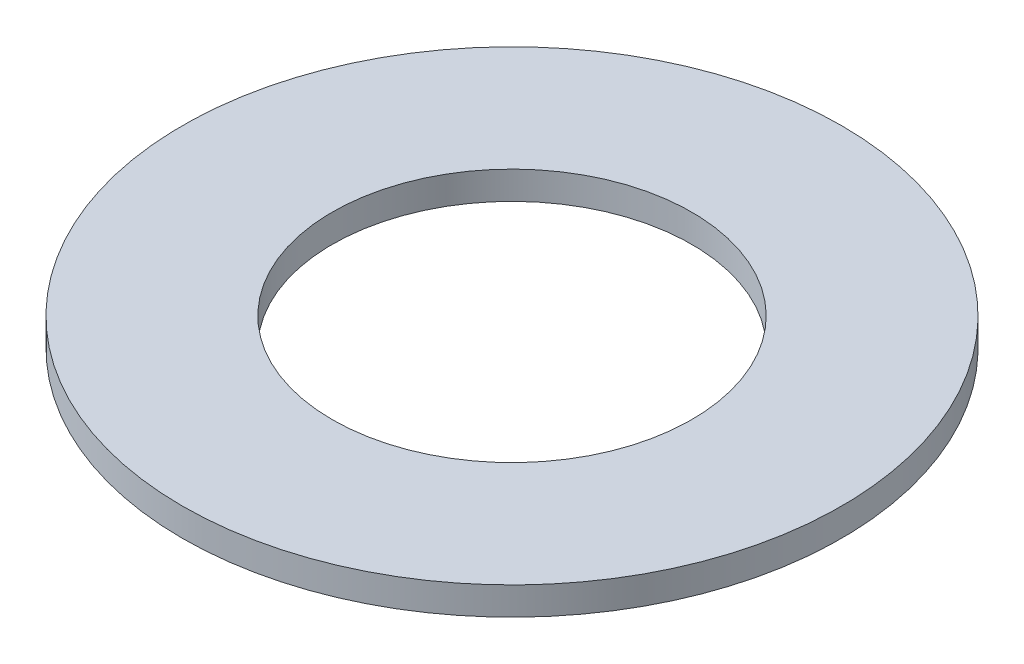
ISO-10303-21;
HEADER;
FILE_DESCRIPTION(('STEP AP214'),'2;1');
FILE_NAME('part.step','',(''),(''),'','','');
FILE_SCHEMA(('AUTOMOTIVE_DESIGN { 1 0 10303 214 1 1 1 1 }'));
ENDSEC;
DATA;
#1=APPLICATION_CONTEXT('core data for automotive mechanical design processes');
#2=APPLICATION_PROTOCOL_DEFINITION('international standard','automotive_design',2000,#1);
#3=PRODUCT_CONTEXT('',#1,'mechanical');
#4=PRODUCT('Part','Part','',(#3));
#5=PRODUCT_RELATED_PRODUCT_CATEGORY('part','',(#4));
#6=PRODUCT_DEFINITION_FORMATION('','',#4);
#7=PRODUCT_DEFINITION_CONTEXT('part definition',#1,'design');
#8=PRODUCT_DEFINITION('design','',#6,#7);
#9=PRODUCT_DEFINITION_SHAPE('','',#8);
#10=(LENGTH_UNIT() NAMED_UNIT(*) SI_UNIT(.MILLI.,.METRE.));
#11=(NAMED_UNIT(*) PLANE_ANGLE_UNIT() SI_UNIT($,.RADIAN.));
#12=(NAMED_UNIT(*) SI_UNIT($,.STERADIAN.) SOLID_ANGLE_UNIT());
#13=UNCERTAINTY_MEASURE_WITH_UNIT(LENGTH_MEASURE(1.E-05),#10,'distance_accuracy_value','');
#14=(GEOMETRIC_REPRESENTATION_CONTEXT(3) GLOBAL_UNCERTAINTY_ASSIGNED_CONTEXT((#13)) GLOBAL_UNIT_ASSIGNED_CONTEXT((#10,
#11,#12)) REPRESENTATION_CONTEXT('',''));
#15=CARTESIAN_POINT('',(0.,0.,0.));
#16=DIRECTION('',(0.,0.,1.));
#17=DIRECTION('',(1.,0.,0.));
#18=AXIS2_PLACEMENT_3D('',#15,#16,#17);
#19=CARTESIAN_POINT('',(0.,7.,0.));
#20=DIRECTION('',(0.,-1.,0.));
#21=DIRECTION('',(0.,0.,-1.));
#22=AXIS2_PLACEMENT_3D('',#19,#20,#21);
#23=CYLINDRICAL_SURFACE('',#22,82.5);
#24=CARTESIAN_POINT('',(0.,7.,0.));
#25=DIRECTION('',(0.,1.,0.));
#26=DIRECTION('',(0.,0.,1.));
#27=AXIS2_PLACEMENT_3D('',#24,#25,#26);
#28=CIRCLE('',#27,82.5);
#29=CARTESIAN_POINT('',(0.,7.,82.5));
#30=VERTEX_POINT('',#29);
#31=EDGE_CURVE('E10',#30,#30,#28,.T.);
#32=ORIENTED_EDGE('',*,*,#31,.F.);
#33=EDGE_LOOP('',(#32));
#34=FACE_BOUND('',#33,.T.);
#35=CARTESIAN_POINT('',(0.,0.,0.));
#36=DIRECTION('',(0.,1.,0.));
#37=DIRECTION('',(0.,0.,1.));
#38=AXIS2_PLACEMENT_3D('',#35,#36,#37);
#39=CIRCLE('',#38,82.5);
#40=CARTESIAN_POINT('',(0.,0.,82.5));
#41=VERTEX_POINT('',#40);
#42=EDGE_CURVE('E37',#41,#41,#39,.T.);
#43=ORIENTED_EDGE('',*,*,#42,.T.);
#44=EDGE_LOOP('',(#43));
#45=FACE_BOUND('',#44,.T.);
#46=ADVANCED_FACE('F40',(#34,#45),#23,.T.);
#47=CARTESIAN_POINT('',(0.,7.,0.));
#48=DIRECTION('',(0.,1.,0.));
#49=DIRECTION('',(0.,0.,1.));
#50=AXIS2_PLACEMENT_3D('',#47,#48,#49);
#51=PLANE('',#50);
#52=CARTESIAN_POINT('',(0.,7.,0.));
#53=DIRECTION('',(0.,1.,0.));
#54=DIRECTION('',(0.,0.,1.));
#55=AXIS2_PLACEMENT_3D('',#52,#53,#54);
#56=CIRCLE('',#55,45.);
#57=CARTESIAN_POINT('',(0.,7.,45.));
#58=VERTEX_POINT('',#57);
#59=EDGE_CURVE('E50',#58,#58,#56,.T.);
#60=ORIENTED_EDGE('',*,*,#59,.F.);
#61=EDGE_LOOP('',(#60));
#62=FACE_BOUND('',#61,.T.);
#63=ORIENTED_EDGE('',*,*,#31,.T.);
#64=EDGE_LOOP('',(#63));
#65=FACE_BOUND('',#64,.T.);
#66=ADVANCED_FACE('F59',(#62,#65),#51,.T.);
#67=CARTESIAN_POINT('',(0.,0.,0.));
#68=DIRECTION('',(0.,1.,0.));
#69=DIRECTION('',(0.,0.,1.));
#70=AXIS2_PLACEMENT_3D('',#67,#68,#69);
#71=PLANE('',#70);
#72=CARTESIAN_POINT('',(0.,0.,0.));
#73=DIRECTION('',(0.,1.,0.));
#74=DIRECTION('',(0.,0.,1.));
#75=AXIS2_PLACEMENT_3D('',#72,#73,#74);
#76=CIRCLE('',#75,45.);
#77=CARTESIAN_POINT('',(0.,0.,45.));
#78=VERTEX_POINT('',#77);
#79=EDGE_CURVE('E47',#78,#78,#76,.T.);
#80=ORIENTED_EDGE('',*,*,#79,.T.);
#81=EDGE_LOOP('',(#80));
#82=FACE_BOUND('',#81,.T.);
#83=ORIENTED_EDGE('',*,*,#42,.F.);
#84=EDGE_LOOP('',(#83));
#85=FACE_BOUND('',#84,.T.);
#86=ADVANCED_FACE('F58',(#82,#85),#71,.F.);
#87=CARTESIAN_POINT('',(0.,7.,0.));
#88=DIRECTION('',(0.,-1.,0.));
#89=DIRECTION('',(0.,0.,-1.));
#90=AXIS2_PLACEMENT_3D('',#87,#88,#89);
#91=CYLINDRICAL_SURFACE('',#90,45.);
#92=ORIENTED_EDGE('',*,*,#59,.T.);
#93=EDGE_LOOP('',(#92));
#94=FACE_BOUND('',#93,.T.);
#95=ORIENTED_EDGE('',*,*,#79,.F.);
#96=EDGE_LOOP('',(#95));
#97=FACE_BOUND('',#96,.T.);
#98=ADVANCED_FACE('F54',(#94,#97),#91,.F.);
#99=CLOSED_SHELL('',(#46,#66,#86,#98));
#100=MANIFOLD_SOLID_BREP('B2',#99);
#101=ADVANCED_BREP_SHAPE_REPRESENTATION('',(#18,#100),#14);
#102=SHAPE_DEFINITION_REPRESENTATION(#9,#101);
ENDSEC;
END-ISO-10303-21;
